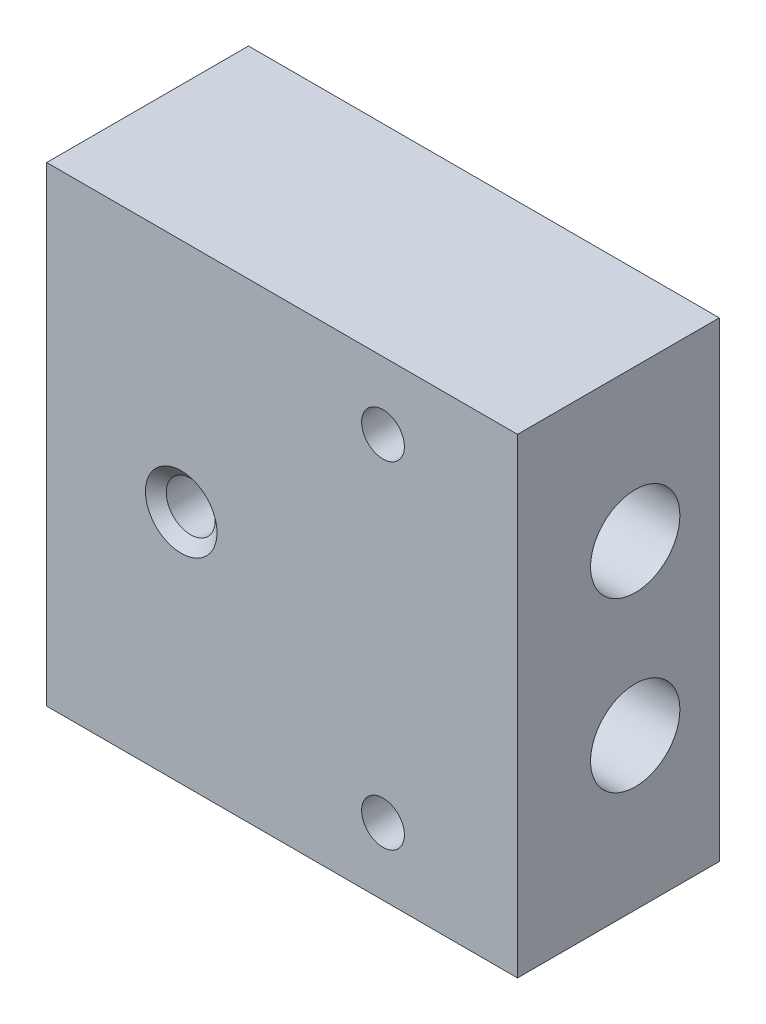
ISO-10303-21;
HEADER;
FILE_DESCRIPTION(('STEP AP214'),'2;1');
FILE_NAME('part.step','',(''),(''),'','','');
FILE_SCHEMA(('AUTOMOTIVE_DESIGN { 1 0 10303 214 1 1 1 1 }'));
ENDSEC;
DATA;
#1=APPLICATION_CONTEXT('core data for automotive mechanical design processes');
#2=APPLICATION_PROTOCOL_DEFINITION('international standard','automotive_design',2000,#1);
#3=PRODUCT_CONTEXT('',#1,'mechanical');
#4=PRODUCT('Part','Part','',(#3));
#5=PRODUCT_RELATED_PRODUCT_CATEGORY('part','',(#4));
#6=PRODUCT_DEFINITION_FORMATION('','',#4);
#7=PRODUCT_DEFINITION_CONTEXT('part definition',#1,'design');
#8=PRODUCT_DEFINITION('design','',#6,#7);
#9=PRODUCT_DEFINITION_SHAPE('','',#8);
#10=(LENGTH_UNIT() NAMED_UNIT(*) SI_UNIT(.MILLI.,.METRE.));
#11=(NAMED_UNIT(*) PLANE_ANGLE_UNIT() SI_UNIT($,.RADIAN.));
#12=(NAMED_UNIT(*) SI_UNIT($,.STERADIAN.) SOLID_ANGLE_UNIT());
#13=UNCERTAINTY_MEASURE_WITH_UNIT(LENGTH_MEASURE(1.E-05),#10,'distance_accuracy_value','');
#14=(GEOMETRIC_REPRESENTATION_CONTEXT(3) GLOBAL_UNCERTAINTY_ASSIGNED_CONTEXT((#13)) GLOBAL_UNIT_ASSIGNED_CONTEXT((#10,
#11,#12)) REPRESENTATION_CONTEXT('',''));
#15=CARTESIAN_POINT('',(0.,0.,0.));
#16=DIRECTION('',(0.,0.,1.));
#17=DIRECTION('',(1.,0.,0.));
#18=AXIS2_PLACEMENT_3D('',#15,#16,#17);
#19=CARTESIAN_POINT('',(-22.225,-22.225,19.05));
#20=DIRECTION('',(0.,1.,0.));
#21=DIRECTION('',(0.,0.,1.));
#22=AXIS2_PLACEMENT_3D('',#19,#20,#21);
#23=PLANE('',#22);
#24=DIRECTION('',(1.,0.,0.));
#25=VECTOR('',#24,1.);
#26=CARTESIAN_POINT('',(-22.225,-22.225,0.));
#27=LINE('',#26,#25);
#28=CARTESIAN_POINT('',(-22.225,-22.225,0.));
#29=VERTEX_POINT('',#28);
#30=CARTESIAN_POINT('',(22.225,-22.225,0.));
#31=VERTEX_POINT('',#30);
#32=EDGE_CURVE('E156',#29,#31,#27,.T.);
#33=ORIENTED_EDGE('',*,*,#32,.T.);
#34=DIRECTION('',(0.,0.,-1.));
#35=VECTOR('',#34,1.);
#36=CARTESIAN_POINT('',(22.225,-22.225,19.05));
#37=LINE('',#36,#35);
#38=CARTESIAN_POINT('',(22.225,-22.225,19.05));
#39=VERTEX_POINT('',#38);
#40=EDGE_CURVE('E106',#39,#31,#37,.T.);
#41=ORIENTED_EDGE('',*,*,#40,.F.);
#42=DIRECTION('',(1.,0.,0.));
#43=VECTOR('',#42,1.);
#44=CARTESIAN_POINT('',(-22.225,-22.225,19.05));
#45=LINE('',#44,#43);
#46=CARTESIAN_POINT('',(-22.225,-22.225,19.05));
#47=VERTEX_POINT('',#46);
#48=EDGE_CURVE('E180',#47,#39,#45,.T.);
#49=ORIENTED_EDGE('',*,*,#48,.F.);
#50=DIRECTION('',(0.,0.,-1.));
#51=VECTOR('',#50,1.);
#52=CARTESIAN_POINT('',(-22.225,-22.225,19.05));
#53=LINE('',#52,#51);
#54=EDGE_CURVE('E159',#47,#29,#53,.T.);
#55=ORIENTED_EDGE('',*,*,#54,.T.);
#56=EDGE_LOOP('',(#33,#41,#49,#55));
#57=FACE_BOUND('',#56,.T.);
#58=ADVANCED_FACE('F39',(#57),#23,.F.);
#59=CARTESIAN_POINT('',(22.225,-22.225,19.05));
#60=DIRECTION('',(-1.,0.,0.));
#61=DIRECTION('',(0.,0.,1.));
#62=AXIS2_PLACEMENT_3D('',#59,#60,#61);
#63=PLANE('',#62);
#64=CARTESIAN_POINT('',(22.225,7.9375,7.9375));
#65=DIRECTION('',(1.,0.,0.));
#66=DIRECTION('',(0.,0.,-1.));
#67=AXIS2_PLACEMENT_3D('',#64,#65,#66);
#68=CIRCLE('',#67,4.2164);
#69=CARTESIAN_POINT('',(22.225,7.9375,3.7211));
#70=VERTEX_POINT('',#69);
#71=EDGE_CURVE('E256',#70,#70,#68,.T.);
#72=ORIENTED_EDGE('',*,*,#71,.F.);
#73=EDGE_LOOP('',(#72));
#74=FACE_BOUND('',#73,.T.);
#75=CARTESIAN_POINT('',(22.225,-7.9375,7.9375));
#76=DIRECTION('',(1.,0.,0.));
#77=DIRECTION('',(0.,0.,-1.));
#78=AXIS2_PLACEMENT_3D('',#75,#76,#77);
#79=CIRCLE('',#78,4.2164);
#80=CARTESIAN_POINT('',(22.225,-7.9375,3.7211));
#81=VERTEX_POINT('',#80);
#82=EDGE_CURVE('E262',#81,#81,#79,.T.);
#83=ORIENTED_EDGE('',*,*,#82,.F.);
#84=EDGE_LOOP('',(#83));
#85=FACE_BOUND('',#84,.T.);
#86=DIRECTION('',(0.,1.,0.));
#87=VECTOR('',#86,1.);
#88=CARTESIAN_POINT('',(22.225,-22.225,0.));
#89=LINE('',#88,#87);
#90=CARTESIAN_POINT('',(22.225,22.225,0.));
#91=VERTEX_POINT('',#90);
#92=EDGE_CURVE('E163',#31,#91,#89,.T.);
#93=ORIENTED_EDGE('',*,*,#92,.T.);
#94=DIRECTION('',(0.,0.,-1.));
#95=VECTOR('',#94,1.);
#96=CARTESIAN_POINT('',(22.225,22.225,19.05));
#97=LINE('',#96,#95);
#98=CARTESIAN_POINT('',(22.225,22.225,19.05));
#99=VERTEX_POINT('',#98);
#100=EDGE_CURVE('E184',#99,#91,#97,.T.);
#101=ORIENTED_EDGE('',*,*,#100,.F.);
#102=DIRECTION('',(0.,1.,0.));
#103=VECTOR('',#102,1.);
#104=CARTESIAN_POINT('',(22.225,-22.225,19.05));
#105=LINE('',#104,#103);
#106=EDGE_CURVE('E187',#39,#99,#105,.T.);
#107=ORIENTED_EDGE('',*,*,#106,.F.);
#108=ORIENTED_EDGE('',*,*,#40,.T.);
#109=EDGE_LOOP('',(#93,#101,#107,#108));
#110=FACE_BOUND('',#109,.T.);
#111=ADVANCED_FACE('F146',(#74,#85,#110),#63,.F.);
#112=CARTESIAN_POINT('',(-22.225,22.225,19.05));
#113=DIRECTION('',(0.,1.,0.));
#114=DIRECTION('',(0.,0.,1.));
#115=AXIS2_PLACEMENT_3D('',#112,#113,#114);
#116=PLANE('',#115);
#117=DIRECTION('',(1.,0.,0.));
#118=VECTOR('',#117,1.);
#119=CARTESIAN_POINT('',(-22.225,22.225,0.));
#120=LINE('',#119,#118);
#121=CARTESIAN_POINT('',(-22.225,22.225,0.));
#122=VERTEX_POINT('',#121);
#123=EDGE_CURVE('E167',#122,#91,#120,.T.);
#124=ORIENTED_EDGE('',*,*,#123,.F.);
#125=DIRECTION('',(0.,0.,-1.));
#126=VECTOR('',#125,1.);
#127=CARTESIAN_POINT('',(-22.225,22.225,19.05));
#128=LINE('',#127,#126);
#129=CARTESIAN_POINT('',(-22.225,22.225,19.05));
#130=VERTEX_POINT('',#129);
#131=EDGE_CURVE('E182',#130,#122,#128,.T.);
#132=ORIENTED_EDGE('',*,*,#131,.F.);
#133=DIRECTION('',(1.,0.,0.));
#134=VECTOR('',#133,1.);
#135=CARTESIAN_POINT('',(-22.225,22.225,19.05));
#136=LINE('',#135,#134);
#137=EDGE_CURVE('E192',#130,#99,#136,.T.);
#138=ORIENTED_EDGE('',*,*,#137,.T.);
#139=ORIENTED_EDGE('',*,*,#100,.T.);
#140=EDGE_LOOP('',(#124,#132,#138,#139));
#141=FACE_BOUND('',#140,.T.);
#142=ADVANCED_FACE('F151',(#141),#116,.T.);
#143=CARTESIAN_POINT('',(-22.225,-22.225,19.05));
#144=DIRECTION('',(-1.,0.,0.));
#145=DIRECTION('',(0.,0.,1.));
#146=AXIS2_PLACEMENT_3D('',#143,#144,#145);
#147=PLANE('',#146);
#148=DIRECTION('',(0.,1.,0.));
#149=VECTOR('',#148,1.);
#150=CARTESIAN_POINT('',(-22.225,-22.225,0.));
#151=LINE('',#150,#149);
#152=EDGE_CURVE('E178',#29,#122,#151,.T.);
#153=ORIENTED_EDGE('',*,*,#152,.F.);
#154=ORIENTED_EDGE('',*,*,#54,.F.);
#155=DIRECTION('',(0.,1.,0.));
#156=VECTOR('',#155,1.);
#157=CARTESIAN_POINT('',(-22.225,-22.225,19.05));
#158=LINE('',#157,#156);
#159=EDGE_CURVE('E173',#47,#130,#158,.T.);
#160=ORIENTED_EDGE('',*,*,#159,.T.);
#161=ORIENTED_EDGE('',*,*,#131,.T.);
#162=EDGE_LOOP('',(#153,#154,#160,#161));
#163=FACE_BOUND('',#162,.T.);
#164=ADVANCED_FACE('F201',(#163),#147,.T.);
#165=CARTESIAN_POINT('',(0.,0.,19.05));
#166=DIRECTION('',(0.,0.,1.));
#167=DIRECTION('',(1.,0.,0.));
#168=AXIS2_PLACEMENT_3D('',#165,#166,#167);
#169=PLANE('',#168);
#170=CARTESIAN_POINT('',(9.525,15.875,19.05));
#171=DIRECTION('',(0.,0.,1.));
#172=DIRECTION('',(1.,0.,0.));
#173=AXIS2_PLACEMENT_3D('',#170,#171,#172);
#174=CIRCLE('',#173,2.01929999999999);
#175=CARTESIAN_POINT('',(11.5443,15.875,19.05));
#176=VERTEX_POINT('',#175);
#177=EDGE_CURVE('E244',#176,#176,#174,.T.);
#178=ORIENTED_EDGE('',*,*,#177,.F.);
#179=EDGE_LOOP('',(#178));
#180=FACE_BOUND('',#179,.T.);
#181=CARTESIAN_POINT('',(9.525,-15.875,19.05));
#182=DIRECTION('',(0.,0.,1.));
#183=DIRECTION('',(1.,0.,0.));
#184=AXIS2_PLACEMENT_3D('',#181,#182,#183);
#185=CIRCLE('',#184,2.01929999999999);
#186=CARTESIAN_POINT('',(11.5443,-15.875,19.05));
#187=VERTEX_POINT('',#186);
#188=EDGE_CURVE('E250',#187,#187,#185,.T.);
#189=ORIENTED_EDGE('',*,*,#188,.F.);
#190=EDGE_LOOP('',(#189));
#191=FACE_BOUND('',#190,.T.);
#192=CARTESIAN_POINT('',(-9.525,0.,19.05));
#193=DIRECTION('',(0.,0.,1.));
#194=DIRECTION('',(1.,0.,0.));
#195=AXIS2_PLACEMENT_3D('',#192,#193,#194);
#196=CIRCLE('',#195,3.3782);
#197=CARTESIAN_POINT('',(-6.1468,0.,19.05));
#198=VERTEX_POINT('',#197);
#199=EDGE_CURVE('E170',#198,#198,#196,.T.);
#200=ORIENTED_EDGE('',*,*,#199,.F.);
#201=EDGE_LOOP('',(#200));
#202=FACE_BOUND('',#201,.T.);
#203=ORIENTED_EDGE('',*,*,#48,.T.);
#204=ORIENTED_EDGE('',*,*,#106,.T.);
#205=ORIENTED_EDGE('',*,*,#137,.F.);
#206=ORIENTED_EDGE('',*,*,#159,.F.);
#207=EDGE_LOOP('',(#203,#204,#205,#206));
#208=FACE_BOUND('',#207,.T.);
#209=ADVANCED_FACE('F195',(#180,#191,#202,#208),#169,.T.);
#210=CARTESIAN_POINT('',(0.,0.,0.));
#211=DIRECTION('',(0.,0.,1.));
#212=DIRECTION('',(1.,0.,0.));
#213=AXIS2_PLACEMENT_3D('',#210,#211,#212);
#214=PLANE('',#213);
#215=CARTESIAN_POINT('',(-9.525,0.,0.));
#216=DIRECTION('',(0.,0.,-1.));
#217=DIRECTION('',(-1.,0.,0.));
#218=AXIS2_PLACEMENT_3D('',#215,#216,#217);
#219=CIRCLE('',#218,4.21639999999999);
#220=CARTESIAN_POINT('',(-13.7414,0.,0.));
#221=VERTEX_POINT('',#220);
#222=EDGE_CURVE('E110',#221,#221,#219,.T.);
#223=ORIENTED_EDGE('',*,*,#222,.F.);
#224=EDGE_LOOP('',(#223));
#225=FACE_BOUND('',#224,.T.);
#226=CARTESIAN_POINT('',(9.525,15.875,0.));
#227=DIRECTION('',(0.,0.,1.));
#228=DIRECTION('',(1.,0.,0.));
#229=AXIS2_PLACEMENT_3D('',#226,#227,#228);
#230=CIRCLE('',#229,2.0193);
#231=CARTESIAN_POINT('',(11.5443,15.875,0.));
#232=VERTEX_POINT('',#231);
#233=EDGE_CURVE('E247',#232,#232,#230,.T.);
#234=ORIENTED_EDGE('',*,*,#233,.T.);
#235=EDGE_LOOP('',(#234));
#236=FACE_BOUND('',#235,.T.);
#237=CARTESIAN_POINT('',(9.525,-15.875,0.));
#238=DIRECTION('',(0.,0.,1.));
#239=DIRECTION('',(1.,0.,0.));
#240=AXIS2_PLACEMENT_3D('',#237,#238,#239);
#241=CIRCLE('',#240,2.0193);
#242=CARTESIAN_POINT('',(11.5443,-15.875,0.));
#243=VERTEX_POINT('',#242);
#244=EDGE_CURVE('E253',#243,#243,#241,.T.);
#245=ORIENTED_EDGE('',*,*,#244,.T.);
#246=EDGE_LOOP('',(#245));
#247=FACE_BOUND('',#246,.T.);
#248=ORIENTED_EDGE('',*,*,#32,.F.);
#249=ORIENTED_EDGE('',*,*,#152,.T.);
#250=ORIENTED_EDGE('',*,*,#123,.T.);
#251=ORIENTED_EDGE('',*,*,#92,.F.);
#252=EDGE_LOOP('',(#248,#249,#250,#251));
#253=FACE_BOUND('',#252,.T.);
#254=ADVANCED_FACE('F203',(#225,#236,#247,#253),#214,.F.);
#255=CARTESIAN_POINT('',(-9.525,0.,19.05));
#256=DIRECTION('',(0.,0.,1.));
#257=DIRECTION('',(1.,0.,0.));
#258=AXIS2_PLACEMENT_3D('',#255,#256,#257);
#259=CYLINDRICAL_SURFACE('',#258,2.3114);
#260=CARTESIAN_POINT('',(-9.525,0.,10.7966394792475));
#261=DIRECTION('',(0.,0.,-1.));
#262=DIRECTION('',(-1.,0.,0.));
#263=AXIS2_PLACEMENT_3D('',#260,#261,#262);
#264=CIRCLE('',#263,2.3114);
#265=CARTESIAN_POINT('',(-11.8364,0.,10.7966394792475));
#266=VERTEX_POINT('',#265);
#267=EDGE_CURVE('E240',#266,#266,#264,.T.);
#268=ORIENTED_EDGE('',*,*,#267,.T.);
#269=EDGE_LOOP('',(#268));
#270=FACE_BOUND('',#269,.T.);
#271=CARTESIAN_POINT('',(-9.525,0.,18.1548485134601));
#272=DIRECTION('',(0.,0.,1.));
#273=DIRECTION('',(1.,0.,0.));
#274=AXIS2_PLACEMENT_3D('',#271,#272,#273);
#275=CIRCLE('',#274,2.3114);
#276=CARTESIAN_POINT('',(-7.2136,0.,18.1548485134601));
#277=VERTEX_POINT('',#276);
#278=EDGE_CURVE('E164',#277,#277,#275,.T.);
#279=ORIENTED_EDGE('',*,*,#278,.T.);
#280=EDGE_LOOP('',(#279));
#281=FACE_BOUND('',#280,.T.);
#282=ADVANCED_FACE('F213',(#270,#281),#259,.F.);
#283=CARTESIAN_POINT('',(-9.525,0.,19.05));
#284=DIRECTION('',(0.,0.,1.));
#285=DIRECTION('',(1.,0.,0.));
#286=AXIS2_PLACEMENT_3D('',#283,#284,#285);
#287=CONICAL_SURFACE('',#286,3.3782,0.872664625997165);
#288=ORIENTED_EDGE('',*,*,#278,.F.);
#289=EDGE_LOOP('',(#288));
#290=FACE_BOUND('',#289,.T.);
#291=ORIENTED_EDGE('',*,*,#199,.T.);
#292=EDGE_LOOP('',(#291));
#293=FACE_BOUND('',#292,.T.);
#294=ADVANCED_FACE('F220',(#290,#293),#287,.F.);
#295=CARTESIAN_POINT('',(-12.827,-7.9375,7.9375));
#296=DIRECTION('',(1.,0.,0.));
#297=DIRECTION('',(0.,0.,-1.));
#298=AXIS2_PLACEMENT_3D('',#295,#296,#297);
#299=CONICAL_SURFACE('',#298,4.21639999999999,1.02974425867665);
#300=CARTESIAN_POINT('',(-15.3604687140678,-7.93750000000001,7.9375));
#301=VERTEX_POINT('',#300);
#302=VERTEX_LOOP('',#301);
#303=FACE_BOUND('',#302,.T.);
#304=CARTESIAN_POINT('',(-12.827,-7.9375,7.9375));
#305=DIRECTION('',(1.,0.,0.));
#306=DIRECTION('',(0.,0.,-1.));
#307=AXIS2_PLACEMENT_3D('',#304,#305,#306);
#308=CIRCLE('',#307,4.21639999999999);
#309=CARTESIAN_POINT('',(-12.827,-7.9375,3.72110000000001));
#310=VERTEX_POINT('',#309);
#311=EDGE_CURVE('E265',#310,#310,#308,.T.);
#312=ORIENTED_EDGE('',*,*,#311,.T.);
#313=EDGE_LOOP('',(#312));
#314=FACE_BOUND('',#313,.T.);
#315=ADVANCED_FACE('F224',(#303,#314),#299,.F.);
#316=CARTESIAN_POINT('',(22.225,-7.9375,7.9375));
#317=DIRECTION('',(1.,0.,0.));
#318=DIRECTION('',(0.,0.,-1.));
#319=AXIS2_PLACEMENT_3D('',#316,#317,#318);
#320=CYLINDRICAL_SURFACE('',#319,4.21639999999999);
#321=CARTESIAN_POINT('',(-12.8558392188218,-3.88728483031159,9.10958619103965));
#322=CARTESIAN_POINT('',(-12.6973461908047,-3.90311153497882,9.16432285364842));
#323=CARTESIAN_POINT('',(-12.5378961016906,-3.91935540970025,9.21625102907552));
#324=CARTESIAN_POINT('',(-12.2162990711846,-3.95175113353329,9.31389589324772));
#325=CARTESIAN_POINT('',(-12.0541431419645,-3.96790222413236,9.35958314703162));
#326=CARTESIAN_POINT('',(-11.6877159096208,-4.00284547925496,9.45396032686633));
#327=CARTESIAN_POINT('',(-11.4828837121977,-4.0213118566519,9.50063110673604));
#328=CARTESIAN_POINT('',(-11.0703343832167,-4.05437413743608,9.58105205242669));
#329=CARTESIAN_POINT('',(-10.8626169886462,-4.06896968549176,9.61480103218782));
#330=CARTESIAN_POINT('',(-10.4456338152192,-4.09246528211745,9.6679886139134));
#331=CARTESIAN_POINT('',(-10.2363744839573,-4.10138215110262,9.687469504348));
#332=CARTESIAN_POINT('',(-9.81682528590696,-4.11240963036816,9.71144940359429));
#333=CARTESIAN_POINT('',(-9.60653556001881,-4.1145211465844,9.7159504065473));
#334=CARTESIAN_POINT('',(-9.20761636338634,-4.11180654247611,9.71009597599513));
#335=CARTESIAN_POINT('',(-9.01895853603939,-4.10766398269168,9.70120455043165));
#336=CARTESIAN_POINT('',(-8.64278435394211,-4.09412593105207,9.67150367390544));
#337=CARTESIAN_POINT('',(-8.455268005678,-4.08473040937611,9.65069415528434));
#338=CARTESIAN_POINT('',(-8.08157998136922,-4.06163539681643,9.59778021105761));
#339=CARTESIAN_POINT('',(-7.89541367406548,-4.04792369248196,9.5656437023219));
#340=CARTESIAN_POINT('',(-7.52542103735617,-4.01754277466491,9.49106996657737));
#341=CARTESIAN_POINT('',(-7.34159478565446,-4.0008734632452,9.44863239844586));
#342=CARTESIAN_POINT('',(-6.96026872349682,-3.96450742264735,9.35041615759254));
#343=CARTESIAN_POINT('',(-6.76300258077521,-3.9446733096583,9.29378794564916));
#344=CARTESIAN_POINT('',(-6.37136949577722,-3.90509807980128,9.17115830618403));
#345=CARTESIAN_POINT('',(-6.17700327837002,-3.88535698700132,9.10515457712619));
#346=CARTESIAN_POINT('',(-5.79077683134044,-3.84760626174004,8.96514799584245));
#347=CARTESIAN_POINT('',(-5.59891955209006,-3.82959853270575,8.89113653539384));
#348=CARTESIAN_POINT('',(-5.21764888454721,-3.79673880154905,8.73648437958213));
#349=CARTESIAN_POINT('',(-5.02823529706048,-3.7818865406667,8.65584422854863));
#350=CARTESIAN_POINT('',(-4.65155236251191,-3.75648049942679,8.4890639303219));
#351=CARTESIAN_POINT('',(-4.46428305721943,-3.74592680266476,8.40292367620411));
#352=CARTESIAN_POINT('',(-4.09166244486014,-3.73005213381876,8.22610617500828));
#353=CARTESIAN_POINT('',(-3.90631123267051,-3.72473141936808,8.13542870478224));
#354=CARTESIAN_POINT('',(-3.53755720650347,-3.72010520718357,7.95042986943169));
#355=CARTESIAN_POINT('',(-3.35415287070058,-3.72079460181866,7.85611166620976));
#356=CARTESIAN_POINT('',(-2.98910459270339,-3.7288577974524,7.66443996273702));
#357=CARTESIAN_POINT('',(-2.80746041475097,-3.73623069038744,7.56708687656018));
#358=CARTESIAN_POINT('',(-2.54730552965703,-3.75211482272656,7.42517103210118));
#359=CARTESIAN_POINT('',(-2.46806002998596,-3.7576711747636,7.38160720608082));
#360=CARTESIAN_POINT('',(-2.30993178257105,-3.77025318679032,7.29404124934105));
#361=CARTESIAN_POINT('',(-2.23104901871868,-3.7772787808765,7.25003913836538));
#362=CARTESIAN_POINT('',(-2.0737392258184,-3.79284772861684,7.16167956677524));
#363=CARTESIAN_POINT('',(-1.99531181479998,-3.80138953104975,7.11732251317644));
#364=CARTESIAN_POINT('',(-1.8388481885553,-3.82005566641516,7.02824146248627));
#365=CARTESIAN_POINT('',(-1.76081199870836,-3.83018010067952,6.9835174420728));
#366=CARTESIAN_POINT('',(-1.68298458399141,-3.84112528469835,6.93862906147128));
#367=B_SPLINE_CURVE_WITH_KNOTS('',3,(#321,#322,#323,#324,#325,#326,#327,#328,#329,#330,#331,
#332,#333,#334,#335,#336,#337,#338,#339,#340,#341,#342,#343,#344,#345,#346,#347,#348,#349,#350,
#351,#352,#353,#354,#355,#356,#357,#358,#359,#360,#361,#362,#363,#364,#365,#366),.UNSPECIFIED.,
.F.,.F.,(4,2,2,2,2,2,2,2,2,2,2,2,2,2,2,2,2,2,2,2,2,2,4),(0.,0.505283199113841,1.01287281813477,
1.6451467238135,2.27747865043292,2.90792877130065,3.53829496250385,4.10456820736717,
4.670844666965,5.2387381392034,5.80665041997151,6.42494324985566,7.04338812366996,
7.66250455142655,8.28157018975871,8.90064786668036,9.51975602087765,10.1383380835284,
10.7568361141871,11.0286282274617,11.300408151996,11.5719116065799,11.8434324519615),.UNSPECIFIED.);
#368=CARTESIAN_POINT('',(-10.567770669556,-4.08542020980874,9.652));
#369=VERTEX_POINT('',#368);
#370=CARTESIAN_POINT('',(-8.482229330444,-4.08542020980874,9.652));
#371=VERTEX_POINT('',#370);
#372=EDGE_CURVE('E11',#369,#371,#367,.T.);
#373=ORIENTED_EDGE('',*,*,#372,.T.);
#374=CARTESIAN_POINT('',(-8.48222933044402,-4.08542020980874,9.652));
#375=CARTESIAN_POINT('',(-8.43657299571869,-4.07377042970996,9.62581937200527));
#376=CARTESIAN_POINT('',(-8.3921394595004,-4.06160977955914,9.59778415746135));
#377=CARTESIAN_POINT('',(-8.30597715582938,-4.03658510515997,9.53810805963774));
#378=CARTESIAN_POINT('',(-8.2642482763069,-4.02372111009608,9.50646732590586));
#379=CARTESIAN_POINT('',(-8.14370777449529,-3.98461690246223,9.40645948082275));
#380=CARTESIAN_POINT('',(-8.06930606254537,-3.95780159544942,9.33287166134199));
#381=CARTESIAN_POINT('',(-7.93424184591297,-3.90548305840165,9.17357908687971));
#382=CARTESIAN_POINT('',(-7.8735903869371,-3.87998089584748,9.0878646796243));
#383=CARTESIAN_POINT('',(-7.76715362421443,-3.83293615542655,8.90669135440482));
#384=CARTESIAN_POINT('',(-7.72136617641242,-3.81139300668762,8.81123384444522));
#385=CARTESIAN_POINT('',(-7.64509024537034,-3.77435828064268,8.613111708254));
#386=CARTESIAN_POINT('',(-7.61462852701623,-3.75887730069737,8.51043482795144));
#387=CARTESIAN_POINT('',(-7.56923413435724,-3.73546042380603,8.30084273165881));
#388=CARTESIAN_POINT('',(-7.55430778374861,-3.72752759946144,8.19392580812069));
#389=CARTESIAN_POINT('',(-7.5398277046899,-3.71983784549628,7.97619791656695));
#390=CARTESIAN_POINT('',(-7.54064856097608,-3.72028013468466,7.86535485177206));
#391=CARTESIAN_POINT('',(-7.55858535090247,-3.72979121822092,7.64537446422333));
#392=CARTESIAN_POINT('',(-7.57570044906794,-3.73885957027403,7.53623705430496));
#393=CARTESIAN_POINT('',(-7.62641853121904,-3.76486800178101,7.32194713400645));
#394=CARTESIAN_POINT('',(-7.66014400947637,-3.7818665127527,7.21683057935242));
#395=CARTESIAN_POINT('',(-7.74395785031861,-3.82204975425725,7.01460934540711));
#396=CARTESIAN_POINT('',(-7.79404345009283,-3.84523344014948,6.91750331680633));
#397=CARTESIAN_POINT('',(-7.90880886701766,-3.89483893543357,6.73599467524678));
#398=CARTESIAN_POINT('',(-7.97318996540826,-3.92119001486527,6.65138392875616));
#399=CARTESIAN_POINT('',(-8.11576693280146,-3.97465316967145,6.49503175881443));
#400=CARTESIAN_POINT('',(-8.19396087085759,-4.0017651382335,6.42328853938695));
#401=CARTESIAN_POINT('',(-8.36057559281803,-4.05334384289046,6.29553952528934));
#402=CARTESIAN_POINT('',(-8.44877877038704,-4.07785044237218,6.23926550158342));
#403=CARTESIAN_POINT('',(-8.63412121810884,-4.12231012821383,6.14160290736688));
#404=CARTESIAN_POINT('',(-8.73126152279993,-4.14226268647707,6.10021606288633));
#405=CARTESIAN_POINT('',(-8.93277121328634,-4.17586279828755,6.03235641744118));
#406=CARTESIAN_POINT('',(-9.03720416430007,-4.18944404795517,6.00603985066514));
#407=CARTESIAN_POINT('',(-9.24951541004346,-4.20874140088786,5.96904219983769));
#408=CARTESIAN_POINT('',(-9.35739429352722,-4.21445615268979,5.9583638024013));
#409=CARTESIAN_POINT('',(-9.57623384418415,-4.21754121820329,5.95256910778358));
#410=CARTESIAN_POINT('',(-9.68720736473441,-4.21471231445966,5.95782435590697));
#411=CARTESIAN_POINT('',(-9.90660175378724,-4.20053500708136,5.98472020014782));
#412=CARTESIAN_POINT('',(-10.0150225756727,-4.18918644798605,6.00636109525904));
#413=CARTESIAN_POINT('',(-10.2265705129259,-4.15900029461203,6.06611369168707));
#414=CARTESIAN_POINT('',(-10.3296775847069,-4.14013639838311,6.10428328085475));
#415=CARTESIAN_POINT('',(-10.5270682552441,-4.09684031082296,6.19682303634143));
#416=CARTESIAN_POINT('',(-10.6213538087224,-4.07240935721372,6.25118960241681));
#417=CARTESIAN_POINT('',(-10.796393940865,-4.02116152464748,6.37396739197774));
#418=CARTESIAN_POINT('',(-10.877394496573,-3.99440674598561,6.44205386306835));
#419=CARTESIAN_POINT('',(-11.0260967684346,-3.94093845366202,6.59146808939002));
#420=CARTESIAN_POINT('',(-11.0937997170532,-3.91422493640397,6.67279461621107));
#421=CARTESIAN_POINT('',(-11.2135087480815,-3.86408194282391,6.84515666675837));
#422=CARTESIAN_POINT('',(-11.2657435661114,-3.84060767501405,6.93602063128339));
#423=CARTESIAN_POINT('',(-11.3551984797788,-3.79879601750598,7.12595170716849));
#424=CARTESIAN_POINT('',(-11.3924165955366,-3.780459305267,7.22501989814227));
#425=CARTESIAN_POINT('',(-11.451983038774,-3.75045350149189,7.43001014415739));
#426=CARTESIAN_POINT('',(-11.4741175218041,-3.73888061623909,7.53600831752968));
#427=CARTESIAN_POINT('',(-11.5026521772185,-3.72386657049931,7.75067336102547));
#428=CARTESIAN_POINT('',(-11.509049491127,-3.7204268873194,7.85934071235464));
#429=CARTESIAN_POINT('',(-11.5060804883163,-3.7220095570082,8.0788530845714));
#430=CARTESIAN_POINT('',(-11.4963564651583,-3.72722393220621,8.18969212630128));
#431=CARTESIAN_POINT('',(-11.4604467860771,-3.7459952006798,8.4079378626681));
#432=CARTESIAN_POINT('',(-11.4342631736214,-3.75955105835107,8.51534498164108));
#433=CARTESIAN_POINT('',(-11.3655249853902,-3.79367372409499,8.72353663774517));
#434=CARTESIAN_POINT('',(-11.3229819772447,-3.8142355771028,8.82432579557378));
#435=CARTESIAN_POINT('',(-11.2218908891675,-3.86026632852439,9.01636666508651));
#436=CARTESIAN_POINT('',(-11.163338146182,-3.88573665595941,9.10761558732587));
#437=CARTESIAN_POINT('',(-11.0327355742129,-3.9382226239189,9.27594220603345));
#438=CARTESIAN_POINT('',(-10.9610117619184,-3.96519181693313,9.35328797310219));
#439=CARTESIAN_POINT('',(-10.8050172030152,-4.01824746313789,9.49414961075876));
#440=CARTESIAN_POINT('',(-10.7207754644231,-4.04433579044013,9.55769664091225));
#441=CARTESIAN_POINT('',(-10.6105377888752,-4.07432475638767,9.62691137976146));
#442=CARTESIAN_POINT('',(-10.5892843069575,-4.07993140493994,9.63966739079768));
#443=CARTESIAN_POINT('',(-10.567770669556,-4.08542020980874,9.65200000000005));
#444=B_SPLINE_CURVE_WITH_KNOTS('',3,(#374,#375,#376,#377,#378,#379,#380,#381,#382,#383,#384,
#385,#386,#387,#388,#389,#390,#391,#392,#393,#394,#395,#396,#397,#398,#399,#400,#401,#402,#403,
#404,#405,#406,#407,#408,#409,#410,#411,#412,#413,#414,#415,#416,#417,#418,#419,#420,#421,#422,
#423,#424,#425,#426,#427,#428,#429,#430,#431,#432,#433,#434,#435,#436,#437,#438,#439,#440,#441,
#442,#443),.UNSPECIFIED.,.F.,.F.,(4,2,2,2,2,2,2,2,2,2,2,2,2,2,2,2,2,2,2,2,2,2,2,2,2,2,2,2,2,2,2,
2,2,2,4),(0.,0.161614609884136,0.323222518841942,0.645611325516359,0.968258199650864,
1.29085851297495,1.61402027734282,1.93731353383824,2.26830642520839,2.59928234608627,
2.93273646435275,3.26613429974179,3.59312996355118,3.9200799515849,4.24094033218031,
4.5618379015733,4.88600465629777,5.21022709587429,5.54206752764233,5.87391401474743,
6.20693223658702,6.53987649071421,6.8657099956216,7.19151328696544,7.51222587487485,
7.83298073338432,8.15819334791001,8.48346502920912,8.81605098898418,9.14859566617204,
9.48090563412425,9.81331249518887,10.1383910780238,10.462727770703,10.5389463341809),.UNSPECIFIED.);
#445=EDGE_CURVE('E234',#371,#369,#444,.T.);
#446=ORIENTED_EDGE('',*,*,#445,.T.);
#447=EDGE_LOOP('',(#373,#446));
#448=FACE_BOUND('',#447,.T.);
#449=ORIENTED_EDGE('',*,*,#311,.F.);
#450=EDGE_LOOP('',(#449));
#451=FACE_BOUND('',#450,.T.);
#452=ORIENTED_EDGE('',*,*,#82,.T.);
#453=EDGE_LOOP('',(#452));
#454=FACE_BOUND('',#453,.T.);
#455=ADVANCED_FACE('F227',(#448,#451,#454),#320,.F.);
#456=CARTESIAN_POINT('',(-12.827,7.9375,7.9375));
#457=DIRECTION('',(1.,0.,0.));
#458=DIRECTION('',(0.,0.,-1.));
#459=AXIS2_PLACEMENT_3D('',#456,#457,#458);
#460=CONICAL_SURFACE('',#459,4.21639999999999,1.02974425867665);
#461=CARTESIAN_POINT('',(-15.3604687140678,7.93749999999999,7.9375));
#462=VERTEX_POINT('',#461);
#463=VERTEX_LOOP('',#462);
#464=FACE_BOUND('',#463,.T.);
#465=CARTESIAN_POINT('',(-12.827,7.9375,7.9375));
#466=DIRECTION('',(1.,0.,0.));
#467=DIRECTION('',(0.,0.,-1.));
#468=AXIS2_PLACEMENT_3D('',#465,#466,#467);
#469=CIRCLE('',#468,4.21639999999999);
#470=CARTESIAN_POINT('',(-12.827,7.9375,3.72110000000001));
#471=VERTEX_POINT('',#470);
#472=EDGE_CURVE('E259',#471,#471,#469,.T.);
#473=ORIENTED_EDGE('',*,*,#472,.T.);
#474=EDGE_LOOP('',(#473));
#475=FACE_BOUND('',#474,.T.);
#476=ADVANCED_FACE('F142',(#464,#475),#460,.F.);
#477=CARTESIAN_POINT('',(22.225,7.9375,7.9375));
#478=DIRECTION('',(1.,0.,0.));
#479=DIRECTION('',(0.,0.,-1.));
#480=AXIS2_PLACEMENT_3D('',#477,#478,#479);
#481=CYLINDRICAL_SURFACE('',#480,4.21639999999999);
#482=CARTESIAN_POINT('',(-10.567770669556,4.08542020980874,9.652));
#483=CARTESIAN_POINT('',(-10.6134270042813,4.07377042970996,9.62581937200527));
#484=CARTESIAN_POINT('',(-10.6578605404996,4.06160977955914,9.59778415746135));
#485=CARTESIAN_POINT('',(-10.7440228441706,4.03658510515996,9.53810805963774));
#486=CARTESIAN_POINT('',(-10.7857517236931,4.02372111009608,9.50646732590586));
#487=CARTESIAN_POINT('',(-10.9062922255047,3.98461690246222,9.40645948082275));
#488=CARTESIAN_POINT('',(-10.9806939374547,3.95780159544941,9.33287166134199));
#489=CARTESIAN_POINT('',(-11.115758154087,3.90548305840164,9.1735790868797));
#490=CARTESIAN_POINT('',(-11.1764096130629,3.87998089584748,9.08786467962429));
#491=CARTESIAN_POINT('',(-11.2828463757856,3.83293615542654,8.90669135440481));
#492=CARTESIAN_POINT('',(-11.3286338235876,3.81139300668761,8.81123384444521));
#493=CARTESIAN_POINT('',(-11.4049097546297,3.77435828064268,8.61311170825399));
#494=CARTESIAN_POINT('',(-11.4353714729838,3.75887730069736,8.51043482795142));
#495=CARTESIAN_POINT('',(-11.4807658656428,3.73546042380603,8.30084273165879));
#496=CARTESIAN_POINT('',(-11.4956922162514,3.72752759946143,8.19392580812068));
#497=CARTESIAN_POINT('',(-11.5101722953101,3.71983784549627,7.97619791656694));
#498=CARTESIAN_POINT('',(-11.5093514390239,3.72028013468466,7.86535485177204));
#499=CARTESIAN_POINT('',(-11.4914146490975,3.72979121822092,7.6453744642233));
#500=CARTESIAN_POINT('',(-11.4742995509321,3.73885957027403,7.53623705430494));
#501=CARTESIAN_POINT('',(-11.423581468781,3.76486800178101,7.32194713400643));
#502=CARTESIAN_POINT('',(-11.3898559905236,3.7818665127527,7.2168305793524));
#503=CARTESIAN_POINT('',(-11.3060421496814,3.82204975425725,7.01460934540709));
#504=CARTESIAN_POINT('',(-11.2559565499072,3.84523344014948,6.91750331680631));
#505=CARTESIAN_POINT('',(-11.1411911329823,3.89483893543357,6.73599467524676));
#506=CARTESIAN_POINT('',(-11.0768100345917,3.92119001486527,6.65138392875614));
#507=CARTESIAN_POINT('',(-10.9342330671985,3.97465316967145,6.49503175881441));
#508=CARTESIAN_POINT('',(-10.8560391291424,4.00176513823351,6.42328853938693));
#509=CARTESIAN_POINT('',(-10.689424407182,4.05334384289046,6.29553952528932));
#510=CARTESIAN_POINT('',(-10.6012212296129,4.07785044237218,6.2392655015834));
#511=CARTESIAN_POINT('',(-10.4158787818911,4.12231012821384,6.14160290736686));
#512=CARTESIAN_POINT('',(-10.3187384772001,4.14226268647708,6.10021606288631));
#513=CARTESIAN_POINT('',(-10.1172287867136,4.17586279828755,6.03235641744117));
#514=CARTESIAN_POINT('',(-10.0127958356999,4.18944404795517,6.00603985066513));
#515=CARTESIAN_POINT('',(-9.80048458995652,4.20874140088787,5.96904219983768));
#516=CARTESIAN_POINT('',(-9.69260570647276,4.21445615268979,5.95836380240129));
#517=CARTESIAN_POINT('',(-9.47376615581584,4.21754121820328,5.95256910778357));
#518=CARTESIAN_POINT('',(-9.36279263526557,4.21471231445965,5.95782435590697));
#519=CARTESIAN_POINT('',(-9.14339824621274,4.20053500708136,5.98472020014781));
#520=CARTESIAN_POINT('',(-9.03497742432725,4.18918644798604,6.00636109525904));
#521=CARTESIAN_POINT('',(-8.82342948707413,4.15900029461203,6.06611369168707));
#522=CARTESIAN_POINT('',(-8.72032241529303,4.1401363983831,6.10428328085475));
#523=CARTESIAN_POINT('',(-8.5229317447559,4.09684031082296,6.19682303634143));
#524=CARTESIAN_POINT('',(-8.42864619127755,4.07240935721371,6.25118960241682));
#525=CARTESIAN_POINT('',(-8.25360605913496,4.02116152464748,6.37396739197774));
#526=CARTESIAN_POINT('',(-8.17260550342694,3.99440674598561,6.44205386306836));
#527=CARTESIAN_POINT('',(-8.02390323156537,3.94093845366201,6.59146808939003));
#528=CARTESIAN_POINT('',(-7.9562002829468,3.91422493640396,6.67279461621109));
#529=CARTESIAN_POINT('',(-7.83649125191845,3.8640819428239,6.84515666675839));
#530=CARTESIAN_POINT('',(-7.78425643388855,3.84060767501404,6.9360206312834));
#531=CARTESIAN_POINT('',(-7.69480152022115,3.79879601750597,7.1259517071685));
#532=CARTESIAN_POINT('',(-7.65758340446336,3.78045930526699,7.22501989814228));
#533=CARTESIAN_POINT('',(-7.59801696122594,3.75045350149188,7.43001014415741));
#534=CARTESIAN_POINT('',(-7.57588247819593,3.73888061623909,7.5360083175297));
#535=CARTESIAN_POINT('',(-7.54734782278148,3.7238665704993,7.75067336102549));
#536=CARTESIAN_POINT('',(-7.54095050887295,3.7204268873194,7.85934071235466));
#537=CARTESIAN_POINT('',(-7.54391951168369,3.7220095570082,8.07885308457143));
#538=CARTESIAN_POINT('',(-7.5536435348417,3.72722393220621,8.1896921263013));
#539=CARTESIAN_POINT('',(-7.58955321392292,3.7459952006798,8.40793786266813));
#540=CARTESIAN_POINT('',(-7.61573682637858,3.75955105835107,8.5153449816411));
#541=CARTESIAN_POINT('',(-7.6844750146098,3.79367372409499,8.72353663774519));
#542=CARTESIAN_POINT('',(-7.72701802275533,3.8142355771028,8.82432579557381));
#543=CARTESIAN_POINT('',(-7.82810911083246,3.86026632852439,9.01636666508653));
#544=CARTESIAN_POINT('',(-7.88666185381802,3.88573665595941,9.10761558732589));
#545=CARTESIAN_POINT('',(-8.01726442578713,3.9382226239189,9.27594220603347));
#546=CARTESIAN_POINT('',(-8.08898823808157,3.96519181693313,9.35328797310221));
#547=CARTESIAN_POINT('',(-8.2449827969848,4.01824746313789,9.49414961075878));
#548=CARTESIAN_POINT('',(-8.32922453557694,4.04433579044014,9.55769664091227));
#549=CARTESIAN_POINT('',(-8.43946221112477,4.07432475638767,9.62691137976148));
#550=CARTESIAN_POINT('',(-8.46071569304252,4.07993140493994,9.63966739079768));
#551=CARTESIAN_POINT('',(-8.48222933044397,4.08542020980874,9.65200000000005));
#552=B_SPLINE_CURVE_WITH_KNOTS('',3,(#482,#483,#484,#485,#486,#487,#488,#489,#490,#491,#492,
#493,#494,#495,#496,#497,#498,#499,#500,#501,#502,#503,#504,#505,#506,#507,#508,#509,#510,#511,
#512,#513,#514,#515,#516,#517,#518,#519,#520,#521,#522,#523,#524,#525,#526,#527,#528,#529,#530,
#531,#532,#533,#534,#535,#536,#537,#538,#539,#540,#541,#542,#543,#544,#545,#546,#547,#548,#549,
#550,#551),.UNSPECIFIED.,.F.,.F.,(4,2,2,2,2,2,2,2,2,2,2,2,2,2,2,2,2,2,2,2,2,2,2,2,2,2,2,2,2,2,2,
2,2,2,4),(0.,0.161614609884139,0.323222518841944,0.645611325516364,0.968258199650868,
1.29085851297496,1.61402027734283,1.93731353383825,2.2683064252084,2.59928234608628,
2.93273646435276,3.2661342997418,3.5931299635512,3.92007995158492,4.24094033218033,
4.56183790157332,4.88600465629779,5.21022709587431,5.54206752764235,5.87391401474746,
6.20693223658704,6.53987649071424,6.86570999562163,7.19151328696547,7.51222587487488,
7.83298073338435,8.15819334791004,8.48346502920916,8.81605098898422,9.14859566617208,
9.48090563412429,9.81331249518891,10.1383910780238,10.462727770703,10.5389463341809),.UNSPECIFIED.);
#553=CARTESIAN_POINT('',(-10.567770669556,4.08542020980874,9.652));
#554=VERTEX_POINT('',#553);
#555=CARTESIAN_POINT('',(-8.482229330444,4.08542020980874,9.652));
#556=VERTEX_POINT('',#555);
#557=EDGE_CURVE('E99',#554,#556,#552,.T.);
#558=ORIENTED_EDGE('',*,*,#557,.T.);
#559=CARTESIAN_POINT('',(-7.15902960217013,3.98346271288447,9.40161));
#560=CARTESIAN_POINT('',(-7.26149570624842,3.99323504423091,9.42800280813263));
#561=CARTESIAN_POINT('',(-7.36435416288389,4.00277295602665,9.45294907569338));
#562=CARTESIAN_POINT('',(-7.5708546962503,4.02112282225441,9.4997575938424));
#563=CARTESIAN_POINT('',(-7.67449692165934,4.02993463497465,9.52161924300011));
#564=CARTESIAN_POINT('',(-7.98675868744452,4.05490713607598,9.58231910767673));
#565=CARTESIAN_POINT('',(-8.19649531235193,4.06958300027923,9.61621526977896));
#566=CARTESIAN_POINT('',(-8.61374331858294,4.09289068581306,9.66892455816815));
#567=CARTESIAN_POINT('',(-8.82120974824331,4.10164228763097,9.68803778797357));
#568=CARTESIAN_POINT('',(-9.23703506933452,4.11244873564242,9.71153161520539));
#569=CARTESIAN_POINT('',(-9.44539326527211,4.11450808991667,9.71592213031802));
#570=CARTESIAN_POINT('',(-9.84083689222642,4.11181700605542,9.71011864800118));
#571=CARTESIAN_POINT('',(-10.0279499262839,4.1077319592843,9.70134992043763));
#572=CARTESIAN_POINT('',(-10.4011499809046,4.09438648894064,9.67207894553338));
#573=CARTESIAN_POINT('',(-10.587236441354,4.08512347729958,9.65157083044765));
#574=CARTESIAN_POINT('',(-10.9611375670576,4.06215379115508,9.59899093671823));
#575=CARTESIAN_POINT('',(-11.1489167871651,4.04836519209327,9.56670464062525));
#576=CARTESIAN_POINT('',(-11.4286860333668,4.02542841682965,9.51043719541295));
#577=CARTESIAN_POINT('',(-11.5215846311868,4.01741127723446,9.49038578931837));
#578=CARTESIAN_POINT('',(-11.7067508552298,4.00081320752393,9.44781422773051));
#579=CARTESIAN_POINT('',(-11.7990185673394,3.99223235590827,9.42529441568416));
#580=CARTESIAN_POINT('',(-11.8909703978299,3.98346271288426,9.40161000000011));
#581=B_SPLINE_CURVE_WITH_KNOTS('',3,(#559,#560,#561,#562,#563,#564,#565,#566,#567,#568,#569,
#570,#571,#572,#573,#574,#575,#576,#577,#578,#579,#580),.UNSPECIFIED.,.F.,.F.,(4,2,2,2,2,2,2,2,
2,2,4),(0.,0.318762923212731,0.637587912326585,1.27591581055404,1.90091787001748,
2.52549882365905,3.087132893281,3.64904793213598,4.22175461920086,4.50785157014171,
4.7939087647808),.UNSPECIFIED.);
#582=EDGE_CURVE('E52',#556,#554,#581,.T.);
#583=ORIENTED_EDGE('',*,*,#582,.T.);
#584=EDGE_LOOP('',(#558,#583));
#585=FACE_BOUND('',#584,.T.);
#586=ORIENTED_EDGE('',*,*,#472,.F.);
#587=EDGE_LOOP('',(#586));
#588=FACE_BOUND('',#587,.T.);
#589=ORIENTED_EDGE('',*,*,#71,.T.);
#590=EDGE_LOOP('',(#589));
#591=FACE_BOUND('',#590,.T.);
#592=ADVANCED_FACE('F112',(#585,#588,#591),#481,.F.);
#593=CARTESIAN_POINT('',(9.525,-15.875,19.05));
#594=DIRECTION('',(0.,0.,1.));
#595=DIRECTION('',(1.,0.,0.));
#596=AXIS2_PLACEMENT_3D('',#593,#594,#595);
#597=CYLINDRICAL_SURFACE('',#596,2.0193);
#598=ORIENTED_EDGE('',*,*,#244,.F.);
#599=EDGE_LOOP('',(#598));
#600=FACE_BOUND('',#599,.T.);
#601=ORIENTED_EDGE('',*,*,#188,.T.);
#602=EDGE_LOOP('',(#601));
#603=FACE_BOUND('',#602,.T.);
#604=ADVANCED_FACE('F135',(#600,#603),#597,.F.);
#605=CARTESIAN_POINT('',(9.525,15.875,19.05));
#606=DIRECTION('',(0.,0.,1.));
#607=DIRECTION('',(1.,0.,0.));
#608=AXIS2_PLACEMENT_3D('',#605,#606,#607);
#609=CYLINDRICAL_SURFACE('',#608,2.0193);
#610=ORIENTED_EDGE('',*,*,#233,.F.);
#611=EDGE_LOOP('',(#610));
#612=FACE_BOUND('',#611,.T.);
#613=ORIENTED_EDGE('',*,*,#177,.T.);
#614=EDGE_LOOP('',(#613));
#615=FACE_BOUND('',#614,.T.);
#616=ADVANCED_FACE('F131',(#612,#615),#609,.F.);
#617=CARTESIAN_POINT('',(-9.525,0.,9.652));
#618=DIRECTION('',(0.,0.,-1.));
#619=DIRECTION('',(-1.,0.,0.));
#620=AXIS2_PLACEMENT_3D('',#617,#618,#619);
#621=CONICAL_SURFACE('',#620,4.2164,1.02974425867665);
#622=CARTESIAN_POINT('',(-9.525,0.,9.652));
#623=DIRECTION('',(0.,0.,-1.));
#624=DIRECTION('',(-1.,0.,0.));
#625=AXIS2_PLACEMENT_3D('',#622,#623,#624);
#626=CIRCLE('',#625,4.2164);
#627=EDGE_CURVE('E59',#556,#371,#626,.T.);
#628=ORIENTED_EDGE('',*,*,#627,.T.);
#629=ORIENTED_EDGE('',*,*,#372,.F.);
#630=EDGE_CURVE('E102',#369,#554,#626,.T.);
#631=ORIENTED_EDGE('',*,*,#630,.T.);
#632=ORIENTED_EDGE('',*,*,#582,.F.);
#633=EDGE_LOOP('',(#628,#629,#631,#632));
#634=FACE_BOUND('',#633,.T.);
#635=ORIENTED_EDGE('',*,*,#267,.F.);
#636=EDGE_LOOP('',(#635));
#637=FACE_BOUND('',#636,.T.);
#638=ADVANCED_FACE('F108',(#634,#637),#621,.F.);
#639=CARTESIAN_POINT('',(-9.525,0.,0.));
#640=DIRECTION('',(0.,0.,-1.));
#641=DIRECTION('',(-1.,0.,0.));
#642=AXIS2_PLACEMENT_3D('',#639,#640,#641);
#643=CYLINDRICAL_SURFACE('',#642,4.21639999999999);
#644=ORIENTED_EDGE('',*,*,#222,.T.);
#645=EDGE_LOOP('',(#644));
#646=FACE_BOUND('',#645,.T.);
#647=ORIENTED_EDGE('',*,*,#627,.F.);
#648=ORIENTED_EDGE('',*,*,#557,.F.);
#649=ORIENTED_EDGE('',*,*,#630,.F.);
#650=ORIENTED_EDGE('',*,*,#445,.F.);
#651=EDGE_LOOP('',(#647,#648,#649,#650));
#652=FACE_BOUND('',#651,.T.);
#653=ADVANCED_FACE('F101',(#646,#652),#643,.F.);
#654=CLOSED_SHELL('',(#58,#111,#142,#164,#209,#254,#282,#294,#315,#455,#476,#592,#604,#616,#638,#653));
#655=MANIFOLD_SOLID_BREP('B2',#654);
#656=ADVANCED_BREP_SHAPE_REPRESENTATION('',(#18,#655),#14);
#657=SHAPE_DEFINITION_REPRESENTATION(#9,#656);
ENDSEC;
END-ISO-10303-21;
